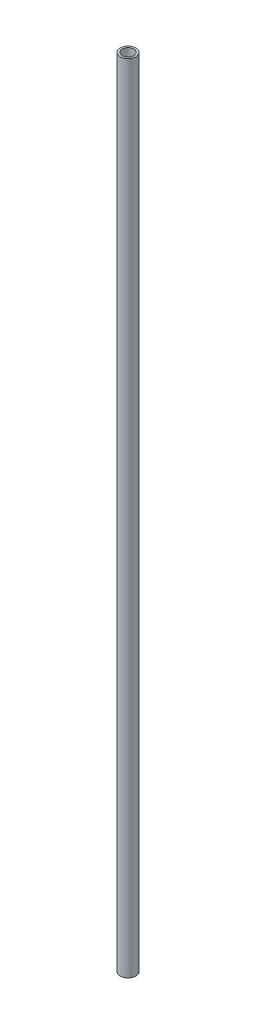
ISO-10303-21;
HEADER;
FILE_DESCRIPTION(('STEP AP214'),'2;1');
FILE_NAME('part.step','',(''),(''),'','','');
FILE_SCHEMA(('AUTOMOTIVE_DESIGN { 1 0 10303 214 1 1 1 1 }'));
ENDSEC;
DATA;
#1=APPLICATION_CONTEXT('core data for automotive mechanical design processes');
#2=APPLICATION_PROTOCOL_DEFINITION('international standard','automotive_design',2000,#1);
#3=PRODUCT_CONTEXT('',#1,'mechanical');
#4=PRODUCT('Part','Part','',(#3));
#5=PRODUCT_RELATED_PRODUCT_CATEGORY('part','',(#4));
#6=PRODUCT_DEFINITION_FORMATION('','',#4);
#7=PRODUCT_DEFINITION_CONTEXT('part definition',#1,'design');
#8=PRODUCT_DEFINITION('design','',#6,#7);
#9=PRODUCT_DEFINITION_SHAPE('','',#8);
#10=(LENGTH_UNIT() NAMED_UNIT(*) SI_UNIT(.MILLI.,.METRE.));
#11=(NAMED_UNIT(*) PLANE_ANGLE_UNIT() SI_UNIT($,.RADIAN.));
#12=(NAMED_UNIT(*) SI_UNIT($,.STERADIAN.) SOLID_ANGLE_UNIT());
#13=UNCERTAINTY_MEASURE_WITH_UNIT(LENGTH_MEASURE(1.E-05),#10,'distance_accuracy_value','');
#14=(GEOMETRIC_REPRESENTATION_CONTEXT(3) GLOBAL_UNCERTAINTY_ASSIGNED_CONTEXT((#13)) GLOBAL_UNIT_ASSIGNED_CONTEXT((#10,
#11,#12)) REPRESENTATION_CONTEXT('',''));
#15=CARTESIAN_POINT('',(0.,0.,0.));
#16=DIRECTION('',(0.,0.,1.));
#17=DIRECTION('',(1.,0.,0.));
#18=AXIS2_PLACEMENT_3D('',#15,#16,#17);
#19=CARTESIAN_POINT('',(0.,2000.,0.));
#20=DIRECTION('',(0.,1.,0.));
#21=DIRECTION('',(0.,0.,1.));
#22=AXIS2_PLACEMENT_3D('',#19,#20,#21);
#23=PLANE('',#22);
#24=CARTESIAN_POINT('',(0.,2000.,0.));
#25=DIRECTION('',(0.,1.,0.));
#26=DIRECTION('',(0.,0.,1.));
#27=AXIS2_PLACEMENT_3D('',#24,#25,#26);
#28=CIRCLE('',#27,19.5);
#29=CARTESIAN_POINT('',(0.,2000.,19.5));
#30=VERTEX_POINT('',#29);
#31=EDGE_CURVE('E10',#30,#30,#28,.T.);
#32=ORIENTED_EDGE('',*,*,#31,.T.);
#33=EDGE_LOOP('',(#32));
#34=FACE_BOUND('',#33,.T.);
#35=CARTESIAN_POINT('',(0.,2000.,0.));
#36=DIRECTION('',(0.,1.,0.));
#37=DIRECTION('',(0.,0.,1.));
#38=AXIS2_PLACEMENT_3D('',#35,#36,#37);
#39=CIRCLE('',#38,14.5);
#40=CARTESIAN_POINT('',(0.,2000.,14.5));
#41=VERTEX_POINT('',#40);
#42=EDGE_CURVE('E42',#41,#41,#39,.T.);
#43=ORIENTED_EDGE('',*,*,#42,.F.);
#44=EDGE_LOOP('',(#43));
#45=FACE_BOUND('',#44,.T.);
#46=ADVANCED_FACE('F31',(#34,#45),#23,.T.);
#47=CARTESIAN_POINT('',(0.,0.,0.));
#48=DIRECTION('',(0.,1.,0.));
#49=DIRECTION('',(0.,0.,1.));
#50=AXIS2_PLACEMENT_3D('',#47,#48,#49);
#51=PLANE('',#50);
#52=CARTESIAN_POINT('',(0.,0.,0.));
#53=DIRECTION('',(0.,1.,0.));
#54=DIRECTION('',(0.,0.,1.));
#55=AXIS2_PLACEMENT_3D('',#52,#53,#54);
#56=CIRCLE('',#55,19.5);
#57=CARTESIAN_POINT('',(0.,0.,19.5));
#58=VERTEX_POINT('',#57);
#59=EDGE_CURVE('E35',#58,#58,#56,.T.);
#60=ORIENTED_EDGE('',*,*,#59,.F.);
#61=EDGE_LOOP('',(#60));
#62=FACE_BOUND('',#61,.T.);
#63=CARTESIAN_POINT('',(0.,0.,0.));
#64=DIRECTION('',(0.,1.,0.));
#65=DIRECTION('',(0.,0.,1.));
#66=AXIS2_PLACEMENT_3D('',#63,#64,#65);
#67=CIRCLE('',#66,14.5);
#68=CARTESIAN_POINT('',(0.,0.,14.5));
#69=VERTEX_POINT('',#68);
#70=EDGE_CURVE('E44',#69,#69,#67,.T.);
#71=ORIENTED_EDGE('',*,*,#70,.T.);
#72=EDGE_LOOP('',(#71));
#73=FACE_BOUND('',#72,.T.);
#74=ADVANCED_FACE('F54',(#62,#73),#51,.F.);
#75=CARTESIAN_POINT('',(0.,2000.,0.));
#76=DIRECTION('',(0.,-1.,0.));
#77=DIRECTION('',(0.,0.,-1.));
#78=AXIS2_PLACEMENT_3D('',#75,#76,#77);
#79=CYLINDRICAL_SURFACE('',#78,19.5);
#80=ORIENTED_EDGE('',*,*,#31,.F.);
#81=EDGE_LOOP('',(#80));
#82=FACE_BOUND('',#81,.T.);
#83=ORIENTED_EDGE('',*,*,#59,.T.);
#84=EDGE_LOOP('',(#83));
#85=FACE_BOUND('',#84,.T.);
#86=ADVANCED_FACE('F33',(#82,#85),#79,.T.);
#87=CARTESIAN_POINT('',(0.,2000.,0.));
#88=DIRECTION('',(0.,-1.,0.));
#89=DIRECTION('',(0.,0.,-1.));
#90=AXIS2_PLACEMENT_3D('',#87,#88,#89);
#91=CYLINDRICAL_SURFACE('',#90,14.5);
#92=ORIENTED_EDGE('',*,*,#42,.T.);
#93=EDGE_LOOP('',(#92));
#94=FACE_BOUND('',#93,.T.);
#95=ORIENTED_EDGE('',*,*,#70,.F.);
#96=EDGE_LOOP('',(#95));
#97=FACE_BOUND('',#96,.T.);
#98=ADVANCED_FACE('F50',(#94,#97),#91,.F.);
#99=CLOSED_SHELL('',(#46,#74,#86,#98));
#100=MANIFOLD_SOLID_BREP('B2',#99);
#101=ADVANCED_BREP_SHAPE_REPRESENTATION('',(#18,#100),#14);
#102=SHAPE_DEFINITION_REPRESENTATION(#9,#101);
ENDSEC;
END-ISO-10303-21;
